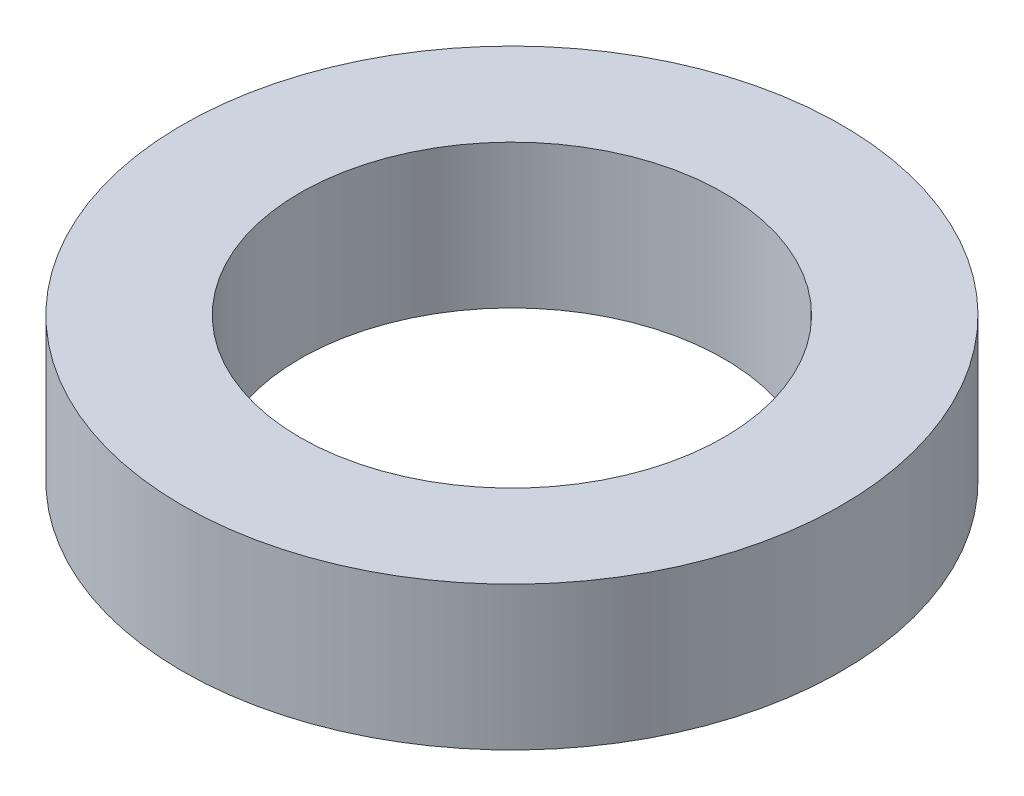
ISO-10303-21;
HEADER;
FILE_DESCRIPTION(('STEP AP214'),'2;1');
FILE_NAME('part.step','',(''),(''),'','','');
FILE_SCHEMA(('AUTOMOTIVE_DESIGN { 1 0 10303 214 1 1 1 1 }'));
ENDSEC;
DATA;
#1=APPLICATION_CONTEXT('core data for automotive mechanical design processes');
#2=APPLICATION_PROTOCOL_DEFINITION('international standard','automotive_design',2000,#1);
#3=PRODUCT_CONTEXT('',#1,'mechanical');
#4=PRODUCT('Part','Part','',(#3));
#5=PRODUCT_RELATED_PRODUCT_CATEGORY('part','',(#4));
#6=PRODUCT_DEFINITION_FORMATION('','',#4);
#7=PRODUCT_DEFINITION_CONTEXT('part definition',#1,'design');
#8=PRODUCT_DEFINITION('design','',#6,#7);
#9=PRODUCT_DEFINITION_SHAPE('','',#8);
#10=(LENGTH_UNIT() NAMED_UNIT(*) SI_UNIT(.MILLI.,.METRE.));
#11=(NAMED_UNIT(*) PLANE_ANGLE_UNIT() SI_UNIT($,.RADIAN.));
#12=(NAMED_UNIT(*) SI_UNIT($,.STERADIAN.) SOLID_ANGLE_UNIT());
#13=UNCERTAINTY_MEASURE_WITH_UNIT(LENGTH_MEASURE(1.E-05),#10,'distance_accuracy_value','');
#14=(GEOMETRIC_REPRESENTATION_CONTEXT(3) GLOBAL_UNCERTAINTY_ASSIGNED_CONTEXT((#13)) GLOBAL_UNIT_ASSIGNED_CONTEXT((#10,
#11,#12)) REPRESENTATION_CONTEXT('',''));
#15=CARTESIAN_POINT('',(0.,0.,0.));
#16=DIRECTION('',(0.,0.,1.));
#17=DIRECTION('',(1.,0.,0.));
#18=AXIS2_PLACEMENT_3D('',#15,#16,#17);
#19=CARTESIAN_POINT('',(0.,12.2,0.));
#20=DIRECTION('',(0.,-1.,0.));
#21=DIRECTION('',(0.,0.,-1.));
#22=AXIS2_PLACEMENT_3D('',#19,#20,#21);
#23=CYLINDRICAL_SURFACE('',#22,28.);
#24=CARTESIAN_POINT('',(0.,12.2,0.));
#25=DIRECTION('',(0.,1.,0.));
#26=DIRECTION('',(0.,0.,1.));
#27=AXIS2_PLACEMENT_3D('',#24,#25,#26);
#28=CIRCLE('',#27,28.);
#29=CARTESIAN_POINT('',(0.,12.2,28.));
#30=VERTEX_POINT('',#29);
#31=EDGE_CURVE('E10',#30,#30,#28,.T.);
#32=ORIENTED_EDGE('',*,*,#31,.F.);
#33=EDGE_LOOP('',(#32));
#34=FACE_BOUND('',#33,.T.);
#35=CARTESIAN_POINT('',(0.,0.,0.));
#36=DIRECTION('',(0.,1.,0.));
#37=DIRECTION('',(0.,0.,1.));
#38=AXIS2_PLACEMENT_3D('',#35,#36,#37);
#39=CIRCLE('',#38,28.);
#40=CARTESIAN_POINT('',(0.,0.,28.));
#41=VERTEX_POINT('',#40);
#42=EDGE_CURVE('E39',#41,#41,#39,.T.);
#43=ORIENTED_EDGE('',*,*,#42,.T.);
#44=EDGE_LOOP('',(#43));
#45=FACE_BOUND('',#44,.T.);
#46=ADVANCED_FACE('F36',(#34,#45),#23,.T.);
#47=CARTESIAN_POINT('',(0.,12.2,0.));
#48=DIRECTION('',(0.,1.,0.));
#49=DIRECTION('',(0.,0.,1.));
#50=AXIS2_PLACEMENT_3D('',#47,#48,#49);
#51=PLANE('',#50);
#52=CARTESIAN_POINT('',(0.,12.2,0.));
#53=DIRECTION('',(0.,1.,0.));
#54=DIRECTION('',(0.,0.,1.));
#55=AXIS2_PLACEMENT_3D('',#52,#53,#54);
#56=CIRCLE('',#55,18.0025);
#57=CARTESIAN_POINT('',(0.,12.2,18.0025));
#58=VERTEX_POINT('',#57);
#59=EDGE_CURVE('E46',#58,#58,#56,.T.);
#60=ORIENTED_EDGE('',*,*,#59,.F.);
#61=EDGE_LOOP('',(#60));
#62=FACE_BOUND('',#61,.T.);
#63=ORIENTED_EDGE('',*,*,#31,.T.);
#64=EDGE_LOOP('',(#63));
#65=FACE_BOUND('',#64,.T.);
#66=ADVANCED_FACE('F57',(#62,#65),#51,.T.);
#67=CARTESIAN_POINT('',(0.,0.,0.));
#68=DIRECTION('',(0.,1.,0.));
#69=DIRECTION('',(0.,0.,1.));
#70=AXIS2_PLACEMENT_3D('',#67,#68,#69);
#71=PLANE('',#70);
#72=CARTESIAN_POINT('',(0.,0.,0.));
#73=DIRECTION('',(0.,1.,0.));
#74=DIRECTION('',(0.,0.,1.));
#75=AXIS2_PLACEMENT_3D('',#72,#73,#74);
#76=CIRCLE('',#75,18.0025);
#77=CARTESIAN_POINT('',(0.,0.,18.0025));
#78=VERTEX_POINT('',#77);
#79=EDGE_CURVE('E48',#78,#78,#76,.T.);
#80=ORIENTED_EDGE('',*,*,#79,.T.);
#81=EDGE_LOOP('',(#80));
#82=FACE_BOUND('',#81,.T.);
#83=ORIENTED_EDGE('',*,*,#42,.F.);
#84=EDGE_LOOP('',(#83));
#85=FACE_BOUND('',#84,.T.);
#86=ADVANCED_FACE('F59',(#82,#85),#71,.F.);
#87=CARTESIAN_POINT('',(0.,12.2,0.));
#88=DIRECTION('',(0.,-1.,0.));
#89=DIRECTION('',(0.,0.,-1.));
#90=AXIS2_PLACEMENT_3D('',#87,#88,#89);
#91=CYLINDRICAL_SURFACE('',#90,18.0025);
#92=ORIENTED_EDGE('',*,*,#59,.T.);
#93=EDGE_LOOP('',(#92));
#94=FACE_BOUND('',#93,.T.);
#95=ORIENTED_EDGE('',*,*,#79,.F.);
#96=EDGE_LOOP('',(#95));
#97=FACE_BOUND('',#96,.T.);
#98=ADVANCED_FACE('F54',(#94,#97),#91,.F.);
#99=CLOSED_SHELL('',(#46,#66,#86,#98));
#100=MANIFOLD_SOLID_BREP('B2',#99);
#101=ADVANCED_BREP_SHAPE_REPRESENTATION('',(#18,#100),#14);
#102=SHAPE_DEFINITION_REPRESENTATION(#9,#101);
ENDSEC;
END-ISO-10303-21;
